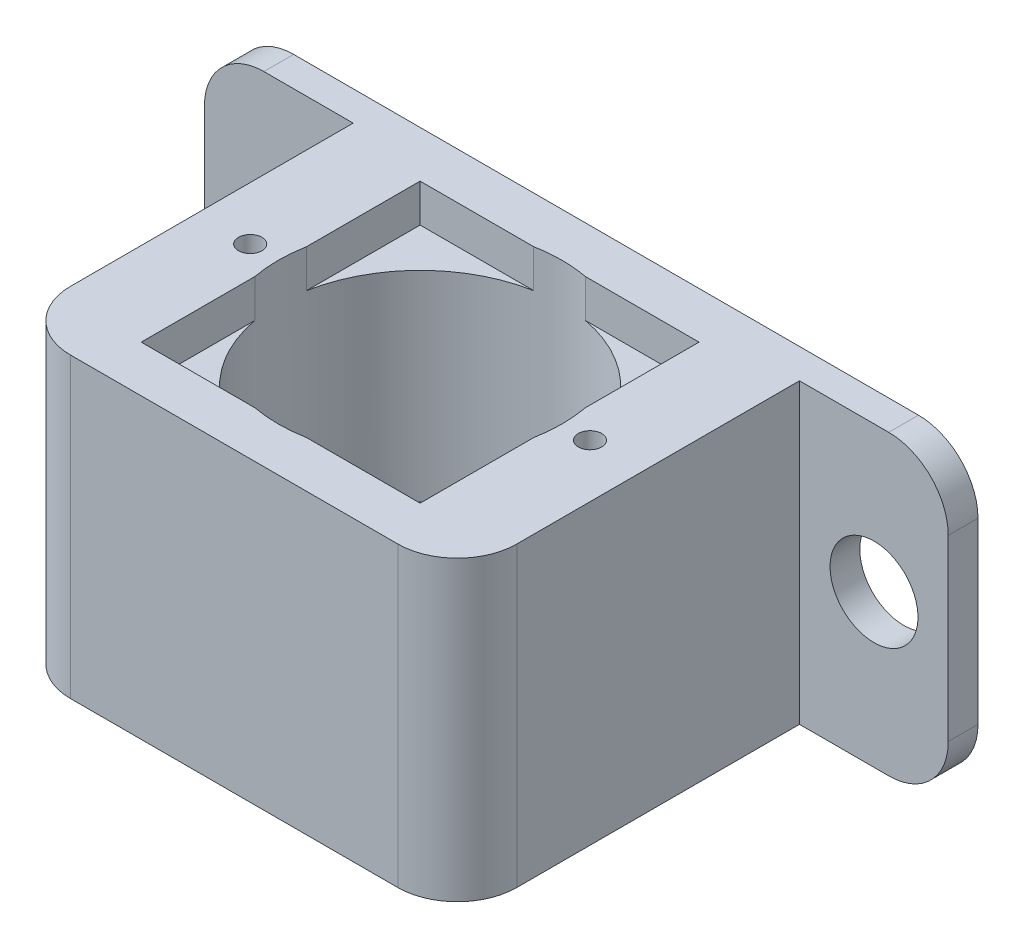
ISO-10303-21;
HEADER;
FILE_DESCRIPTION(('STEP AP214'),'2;1');
FILE_NAME('part.step','',(''),(''),'','','');
FILE_SCHEMA(('AUTOMOTIVE_DESIGN { 1 0 10303 214 1 1 1 1 }'));
ENDSEC;
DATA;
#1=APPLICATION_CONTEXT('core data for automotive mechanical design processes');
#2=APPLICATION_PROTOCOL_DEFINITION('international standard','automotive_design',2000,#1);
#3=PRODUCT_CONTEXT('',#1,'mechanical');
#4=PRODUCT('Part','Part','',(#3));
#5=PRODUCT_RELATED_PRODUCT_CATEGORY('part','',(#4));
#6=PRODUCT_DEFINITION_FORMATION('','',#4);
#7=PRODUCT_DEFINITION_CONTEXT('part definition',#1,'design');
#8=PRODUCT_DEFINITION('design','',#6,#7);
#9=PRODUCT_DEFINITION_SHAPE('','',#8);
#10=(LENGTH_UNIT() NAMED_UNIT(*) SI_UNIT(.MILLI.,.METRE.));
#11=(NAMED_UNIT(*) PLANE_ANGLE_UNIT() SI_UNIT($,.RADIAN.));
#12=(NAMED_UNIT(*) SI_UNIT($,.STERADIAN.) SOLID_ANGLE_UNIT());
#13=UNCERTAINTY_MEASURE_WITH_UNIT(LENGTH_MEASURE(1.E-05),#10,'distance_accuracy_value','');
#14=(GEOMETRIC_REPRESENTATION_CONTEXT(3) GLOBAL_UNCERTAINTY_ASSIGNED_CONTEXT((#13)) GLOBAL_UNIT_ASSIGNED_CONTEXT((#10,
#11,#12)) REPRESENTATION_CONTEXT('',''));
#15=CARTESIAN_POINT('',(0.,0.,0.));
#16=DIRECTION('',(0.,0.,1.));
#17=DIRECTION('',(1.,0.,0.));
#18=AXIS2_PLACEMENT_3D('',#15,#16,#17);
#19=CARTESIAN_POINT('',(0.,-2.54,0.));
#20=DIRECTION('',(0.,-1.,0.));
#21=DIRECTION('',(0.,0.,-1.));
#22=AXIS2_PLACEMENT_3D('',#19,#20,#21);
#23=PLANE('',#22);
#24=CARTESIAN_POINT('',(14.5034,-2.54,0.));
#25=DIRECTION('',(0.,-1.,0.));
#26=DIRECTION('',(0.,0.,-1.));
#27=AXIS2_PLACEMENT_3D('',#24,#25,#26);
#28=CIRCLE('',#27,1.);
#29=CARTESIAN_POINT('',(14.5034,-2.54,-1.));
#30=VERTEX_POINT('',#29);
#31=EDGE_CURVE('E20',#30,#30,#28,.F.);
#32=ORIENTED_EDGE('',*,*,#31,.T.);
#33=EDGE_LOOP('',(#32));
#34=FACE_BOUND('',#33,.T.);
#35=ADVANCED_FACE('F17',(#34),#23,.F.);
#36=CARTESIAN_POINT('',(0.,-2.54,0.));
#37=DIRECTION('',(0.,-1.,0.));
#38=DIRECTION('',(0.,0.,-1.));
#39=AXIS2_PLACEMENT_3D('',#36,#37,#38);
#40=PLANE('',#39);
#41=CARTESIAN_POINT('',(-14.5034,-2.54,0.));
#42=DIRECTION('',(0.,-1.,0.));
#43=DIRECTION('',(0.,0.,-1.));
#44=AXIS2_PLACEMENT_3D('',#41,#42,#43);
#45=CIRCLE('',#44,1.);
#46=CARTESIAN_POINT('',(-14.5034,-2.54,-1.));
#47=VERTEX_POINT('',#46);
#48=EDGE_CURVE('E421',#47,#47,#45,.F.);
#49=ORIENTED_EDGE('',*,*,#48,.T.);
#50=EDGE_LOOP('',(#49));
#51=FACE_BOUND('',#50,.T.);
#52=ADVANCED_FACE('F652',(#51),#40,.F.);
#53=CARTESIAN_POINT('',(-25.4129609454085,-12.4235546093226,-38.735));
#54=DIRECTION('',(0.,0.,-1.));
#55=DIRECTION('',(-1.,0.,0.));
#56=AXIS2_PLACEMENT_3D('',#53,#54,#55);
#57=CYLINDRICAL_SURFACE('',#56,3.754);
#58=CARTESIAN_POINT('',(-25.4129609454085,-12.4235546093226,-13.335));
#59=DIRECTION('',(0.,0.,-1.));
#60=DIRECTION('',(-1.,0.,0.));
#61=AXIS2_PLACEMENT_3D('',#58,#59,#60);
#62=CIRCLE('',#61,3.754);
#63=CARTESIAN_POINT('',(-29.1669609454085,-12.4235546093226,-13.335));
#64=VERTEX_POINT('',#63);
#65=EDGE_CURVE('E377',#64,#64,#62,.F.);
#66=ORIENTED_EDGE('',*,*,#65,.T.);
#67=EDGE_LOOP('',(#66));
#68=FACE_BOUND('',#67,.T.);
#69=CARTESIAN_POINT('',(-25.4129609454085,-12.4235546093226,-15.875));
#70=DIRECTION('',(0.,0.,-1.));
#71=DIRECTION('',(-1.,0.,0.));
#72=AXIS2_PLACEMENT_3D('',#69,#70,#71);
#73=CIRCLE('',#72,3.754);
#74=CARTESIAN_POINT('',(-29.1669609454085,-12.4235546093226,-15.875));
#75=VERTEX_POINT('',#74);
#76=EDGE_CURVE('E460',#75,#75,#73,.F.);
#77=ORIENTED_EDGE('',*,*,#76,.F.);
#78=EDGE_LOOP('',(#77));
#79=FACE_BOUND('',#78,.T.);
#80=ADVANCED_FACE('F646',(#68,#79),#57,.F.);
#81=CARTESIAN_POINT('',(25.4129609454085,-12.4235546093226,-38.735));
#82=DIRECTION('',(0.,0.,-1.));
#83=DIRECTION('',(-1.,0.,0.));
#84=AXIS2_PLACEMENT_3D('',#81,#82,#83);
#85=CYLINDRICAL_SURFACE('',#84,3.754);
#86=CARTESIAN_POINT('',(25.4129609454085,-12.4235546093226,-13.335));
#87=DIRECTION('',(0.,0.,-1.));
#88=DIRECTION('',(-1.,0.,0.));
#89=AXIS2_PLACEMENT_3D('',#86,#87,#88);
#90=CIRCLE('',#89,3.754);
#91=CARTESIAN_POINT('',(21.6589609454085,-12.4235546093226,-13.335));
#92=VERTEX_POINT('',#91);
#93=EDGE_CURVE('E420',#92,#92,#90,.T.);
#94=ORIENTED_EDGE('',*,*,#93,.F.);
#95=EDGE_LOOP('',(#94));
#96=FACE_BOUND('',#95,.T.);
#97=CARTESIAN_POINT('',(25.4129609454085,-12.4235546093226,-15.875));
#98=DIRECTION('',(0.,0.,-1.));
#99=DIRECTION('',(-1.,0.,0.));
#100=AXIS2_PLACEMENT_3D('',#97,#98,#99);
#101=CIRCLE('',#100,3.754);
#102=CARTESIAN_POINT('',(21.6589609454085,-12.4235546093226,-15.875));
#103=VERTEX_POINT('',#102);
#104=EDGE_CURVE('E457',#103,#103,#101,.F.);
#105=ORIENTED_EDGE('',*,*,#104,.F.);
#106=EDGE_LOOP('',(#105));
#107=FACE_BOUND('',#106,.T.);
#108=ADVANCED_FACE('F639',(#96,#107),#85,.F.);
#109=CARTESIAN_POINT('',(-31.75,-12.7,0.));
#110=DIRECTION('',(-1.,0.,0.));
#111=DIRECTION('',(0.,0.,1.));
#112=AXIS2_PLACEMENT_3D('',#109,#110,#111);
#113=PLANE('',#112);
#114=DIRECTION('',(0.,1.,0.));
#115=VECTOR('',#114,1.);
#116=CARTESIAN_POINT('',(-31.75,-12.7,-13.335));
#117=LINE('',#116,#115);
#118=CARTESIAN_POINT('',(-31.75,-20.32,-13.335));
#119=VERTEX_POINT('',#118);
#120=CARTESIAN_POINT('',(-31.75,-5.08,-13.335));
#121=VERTEX_POINT('',#120);
#122=EDGE_CURVE('E370',#119,#121,#117,.T.);
#123=ORIENTED_EDGE('',*,*,#122,.T.);
#124=DIRECTION('',(0.,0.,1.));
#125=VECTOR('',#124,1.);
#126=CARTESIAN_POINT('',(-31.75,-5.08,0.));
#127=LINE('',#126,#125);
#128=CARTESIAN_POINT('',(-31.75,-5.08,-15.875));
#129=VERTEX_POINT('',#128);
#130=EDGE_CURVE('E373',#129,#121,#127,.T.);
#131=ORIENTED_EDGE('',*,*,#130,.F.);
#132=DIRECTION('',(0.,1.,0.));
#133=VECTOR('',#132,1.);
#134=CARTESIAN_POINT('',(-31.75,-25.4,-15.875));
#135=LINE('',#134,#133);
#136=CARTESIAN_POINT('',(-31.75,-20.32,-15.875));
#137=VERTEX_POINT('',#136);
#138=EDGE_CURVE('E353',#137,#129,#135,.T.);
#139=ORIENTED_EDGE('',*,*,#138,.F.);
#140=DIRECTION('',(0.,0.,-1.));
#141=VECTOR('',#140,1.);
#142=CARTESIAN_POINT('',(-31.75,-20.32,0.));
#143=LINE('',#142,#141);
#144=EDGE_CURVE('E417',#119,#137,#143,.T.);
#145=ORIENTED_EDGE('',*,*,#144,.F.);
#146=EDGE_LOOP('',(#123,#131,#139,#145));
#147=FACE_BOUND('',#146,.T.);
#148=ADVANCED_FACE('F637',(#147),#113,.T.);
#149=CARTESIAN_POINT('',(31.75,-12.7,0.));
#150=DIRECTION('',(1.,0.,0.));
#151=DIRECTION('',(0.,0.,-1.));
#152=AXIS2_PLACEMENT_3D('',#149,#150,#151);
#153=PLANE('',#152);
#154=DIRECTION('',(0.,1.,0.));
#155=VECTOR('',#154,1.);
#156=CARTESIAN_POINT('',(31.75,-25.4,-15.875));
#157=LINE('',#156,#155);
#158=CARTESIAN_POINT('',(31.75,-5.08,-15.875));
#159=VERTEX_POINT('',#158);
#160=CARTESIAN_POINT('',(31.75,-20.32,-15.875));
#161=VERTEX_POINT('',#160);
#162=EDGE_CURVE('E349',#159,#161,#157,.F.);
#163=ORIENTED_EDGE('',*,*,#162,.F.);
#164=DIRECTION('',(0.,0.,1.));
#165=VECTOR('',#164,1.);
#166=CARTESIAN_POINT('',(31.75,-5.08,0.));
#167=LINE('',#166,#165);
#168=CARTESIAN_POINT('',(31.75,-5.08,-13.335));
#169=VERTEX_POINT('',#168);
#170=EDGE_CURVE('E418',#169,#159,#167,.F.);
#171=ORIENTED_EDGE('',*,*,#170,.F.);
#172=DIRECTION('',(0.,1.,0.));
#173=VECTOR('',#172,1.);
#174=CARTESIAN_POINT('',(31.75,-12.7,-13.335));
#175=LINE('',#174,#173);
#176=CARTESIAN_POINT('',(31.75,-20.32,-13.335));
#177=VERTEX_POINT('',#176);
#178=EDGE_CURVE('E398',#177,#169,#175,.T.);
#179=ORIENTED_EDGE('',*,*,#178,.F.);
#180=DIRECTION('',(0.,0.,-1.));
#181=VECTOR('',#180,1.);
#182=CARTESIAN_POINT('',(31.75,-20.32,0.));
#183=LINE('',#182,#181);
#184=EDGE_CURVE('E414',#161,#177,#183,.F.);
#185=ORIENTED_EDGE('',*,*,#184,.F.);
#186=EDGE_LOOP('',(#163,#171,#179,#185));
#187=FACE_BOUND('',#186,.T.);
#188=ADVANCED_FACE('F613',(#187),#153,.T.);
#189=CARTESIAN_POINT('',(-26.67,-20.32,0.));
#190=DIRECTION('',(0.,0.,-1.));
#191=DIRECTION('',(-1.,0.,0.));
#192=AXIS2_PLACEMENT_3D('',#189,#190,#191);
#193=CYLINDRICAL_SURFACE('',#192,5.08);
#194=CARTESIAN_POINT('',(-26.67,-20.32,-13.335));
#195=DIRECTION('',(0.,0.,-1.));
#196=DIRECTION('',(-1.,0.,0.));
#197=AXIS2_PLACEMENT_3D('',#194,#195,#196);
#198=CIRCLE('',#197,5.08);
#199=CARTESIAN_POINT('',(-26.67,-25.4,-13.335));
#200=VERTEX_POINT('',#199);
#201=EDGE_CURVE('E374',#200,#119,#198,.T.);
#202=ORIENTED_EDGE('',*,*,#201,.T.);
#203=ORIENTED_EDGE('',*,*,#144,.T.);
#204=CARTESIAN_POINT('',(-26.67,-20.32,-15.875));
#205=DIRECTION('',(0.,0.,-1.));
#206=DIRECTION('',(-1.,0.,0.));
#207=AXIS2_PLACEMENT_3D('',#204,#205,#206);
#208=CIRCLE('',#207,5.08);
#209=CARTESIAN_POINT('',(-26.67,-25.4,-15.875));
#210=VERTEX_POINT('',#209);
#211=EDGE_CURVE('E356',#210,#137,#208,.T.);
#212=ORIENTED_EDGE('',*,*,#211,.F.);
#213=DIRECTION('',(0.,0.,-1.));
#214=VECTOR('',#213,1.);
#215=CARTESIAN_POINT('',(-26.67,-25.4,0.));
#216=LINE('',#215,#214);
#217=EDGE_CURVE('E404',#200,#210,#216,.T.);
#218=ORIENTED_EDGE('',*,*,#217,.F.);
#219=EDGE_LOOP('',(#202,#203,#212,#218));
#220=FACE_BOUND('',#219,.T.);
#221=ADVANCED_FACE('F493',(#220),#193,.T.);
#222=CARTESIAN_POINT('',(26.67,-20.32,0.));
#223=DIRECTION('',(0.,0.,-1.));
#224=DIRECTION('',(-1.,0.,0.));
#225=AXIS2_PLACEMENT_3D('',#222,#223,#224);
#226=CYLINDRICAL_SURFACE('',#225,5.08);
#227=CARTESIAN_POINT('',(26.67,-20.32,-13.335));
#228=DIRECTION('',(0.,0.,-1.));
#229=DIRECTION('',(-1.,0.,0.));
#230=AXIS2_PLACEMENT_3D('',#227,#228,#229);
#231=CIRCLE('',#230,5.08);
#232=CARTESIAN_POINT('',(26.67,-25.4,-13.335));
#233=VERTEX_POINT('',#232);
#234=EDGE_CURVE('E400',#233,#177,#231,.F.);
#235=ORIENTED_EDGE('',*,*,#234,.F.);
#236=DIRECTION('',(0.,0.,-1.));
#237=VECTOR('',#236,1.);
#238=CARTESIAN_POINT('',(26.67,-25.4,0.));
#239=LINE('',#238,#237);
#240=CARTESIAN_POINT('',(26.67,-25.4,-15.875));
#241=VERTEX_POINT('',#240);
#242=EDGE_CURVE('E162',#241,#233,#239,.F.);
#243=ORIENTED_EDGE('',*,*,#242,.F.);
#244=CARTESIAN_POINT('',(26.67,-20.32,-15.875));
#245=DIRECTION('',(0.,0.,-1.));
#246=DIRECTION('',(-1.,0.,0.));
#247=AXIS2_PLACEMENT_3D('',#244,#245,#246);
#248=CIRCLE('',#247,5.08);
#249=EDGE_CURVE('E351',#161,#241,#248,.T.);
#250=ORIENTED_EDGE('',*,*,#249,.F.);
#251=ORIENTED_EDGE('',*,*,#184,.T.);
#252=EDGE_LOOP('',(#235,#243,#250,#251));
#253=FACE_BOUND('',#252,.T.);
#254=ADVANCED_FACE('F482',(#253),#226,.T.);
#255=CARTESIAN_POINT('',(14.5034,-2.54,0.));
#256=DIRECTION('',(0.,-1.,0.));
#257=DIRECTION('',(0.,0.,-1.));
#258=AXIS2_PLACEMENT_3D('',#255,#256,#257);
#259=CYLINDRICAL_SURFACE('',#258,1.);
#260=CARTESIAN_POINT('',(14.5034,0.,0.));
#261=DIRECTION('',(0.,-1.,0.));
#262=DIRECTION('',(0.,0.,-1.));
#263=AXIS2_PLACEMENT_3D('',#260,#261,#262);
#264=CIRCLE('',#263,1.);
#265=CARTESIAN_POINT('',(14.5034,0.,-1.));
#266=VERTEX_POINT('',#265);
#267=EDGE_CURVE('E277',#266,#266,#264,.F.);
#268=ORIENTED_EDGE('',*,*,#267,.T.);
#269=EDGE_LOOP('',(#268));
#270=FACE_BOUND('',#269,.T.);
#271=ORIENTED_EDGE('',*,*,#31,.F.);
#272=EDGE_LOOP('',(#271));
#273=FACE_BOUND('',#272,.T.);
#274=ADVANCED_FACE('F479',(#270,#273),#259,.F.);
#275=CARTESIAN_POINT('',(-14.5034,-2.54,0.));
#276=DIRECTION('',(0.,-1.,0.));
#277=DIRECTION('',(0.,0.,-1.));
#278=AXIS2_PLACEMENT_3D('',#275,#276,#277);
#279=CYLINDRICAL_SURFACE('',#278,1.);
#280=CARTESIAN_POINT('',(-14.5034,0.,0.));
#281=DIRECTION('',(0.,-1.,0.));
#282=DIRECTION('',(0.,0.,-1.));
#283=AXIS2_PLACEMENT_3D('',#280,#281,#282);
#284=CIRCLE('',#283,1.);
#285=CARTESIAN_POINT('',(-14.5034,0.,-1.));
#286=VERTEX_POINT('',#285);
#287=EDGE_CURVE('E365',#286,#286,#284,.F.);
#288=ORIENTED_EDGE('',*,*,#287,.T.);
#289=EDGE_LOOP('',(#288));
#290=FACE_BOUND('',#289,.T.);
#291=ORIENTED_EDGE('',*,*,#48,.F.);
#292=EDGE_LOOP('',(#291));
#293=FACE_BOUND('',#292,.T.);
#294=ADVANCED_FACE('F481',(#290,#293),#279,.F.);
#295=CARTESIAN_POINT('',(26.67,-5.08,0.));
#296=DIRECTION('',(0.,0.,1.));
#297=DIRECTION('',(1.,0.,0.));
#298=AXIS2_PLACEMENT_3D('',#295,#296,#297);
#299=CYLINDRICAL_SURFACE('',#298,5.08);
#300=CARTESIAN_POINT('',(26.67,-5.08,-13.335));
#301=DIRECTION('',(0.,0.,1.));
#302=DIRECTION('',(1.,0.,0.));
#303=AXIS2_PLACEMENT_3D('',#300,#301,#302);
#304=CIRCLE('',#303,5.08);
#305=CARTESIAN_POINT('',(26.67,0.,-13.335));
#306=VERTEX_POINT('',#305);
#307=EDGE_CURVE('E391',#169,#306,#304,.T.);
#308=ORIENTED_EDGE('',*,*,#307,.F.);
#309=ORIENTED_EDGE('',*,*,#170,.T.);
#310=CARTESIAN_POINT('',(26.67,-5.08,-15.875));
#311=DIRECTION('',(0.,0.,1.));
#312=DIRECTION('',(1.,0.,0.));
#313=AXIS2_PLACEMENT_3D('',#310,#311,#312);
#314=CIRCLE('',#313,5.08);
#315=CARTESIAN_POINT('',(26.67,0.,-15.875));
#316=VERTEX_POINT('',#315);
#317=EDGE_CURVE('E352',#316,#159,#314,.F.);
#318=ORIENTED_EDGE('',*,*,#317,.F.);
#319=DIRECTION('',(0.,0.,-1.));
#320=VECTOR('',#319,1.);
#321=CARTESIAN_POINT('',(26.67,0.,0.));
#322=LINE('',#321,#320);
#323=EDGE_CURVE('E362',#316,#306,#322,.F.);
#324=ORIENTED_EDGE('',*,*,#323,.T.);
#325=EDGE_LOOP('',(#308,#309,#318,#324));
#326=FACE_BOUND('',#325,.T.);
#327=ADVANCED_FACE('F490',(#326),#299,.T.);
#328=CARTESIAN_POINT('',(31.75,-12.7,-13.335));
#329=DIRECTION('',(0.,0.,1.));
#330=DIRECTION('',(1.,0.,0.));
#331=AXIS2_PLACEMENT_3D('',#328,#329,#330);
#332=PLANE('',#331);
#333=DIRECTION('',(1.,0.,0.));
#334=VECTOR('',#333,1.);
#335=CARTESIAN_POINT('',(0.,0.,-13.335));
#336=LINE('',#335,#334);
#337=CARTESIAN_POINT('',(19.05,0.,-13.335));
#338=VERTEX_POINT('',#337);
#339=EDGE_CURVE('E268',#306,#338,#336,.F.);
#340=ORIENTED_EDGE('',*,*,#339,.T.);
#341=DIRECTION('',(0.,1.,0.));
#342=VECTOR('',#341,1.);
#343=CARTESIAN_POINT('',(19.05,-25.4,-13.335));
#344=LINE('',#343,#342);
#345=CARTESIAN_POINT('',(19.05,-25.4,-13.335));
#346=VERTEX_POINT('',#345);
#347=EDGE_CURVE('E389',#338,#346,#344,.F.);
#348=ORIENTED_EDGE('',*,*,#347,.T.);
#349=DIRECTION('',(1.,0.,0.));
#350=VECTOR('',#349,1.);
#351=CARTESIAN_POINT('',(0.,-25.4,-13.335));
#352=LINE('',#351,#350);
#353=EDGE_CURVE('E165',#233,#346,#352,.F.);
#354=ORIENTED_EDGE('',*,*,#353,.F.);
#355=ORIENTED_EDGE('',*,*,#234,.T.);
#356=ORIENTED_EDGE('',*,*,#178,.T.);
#357=ORIENTED_EDGE('',*,*,#307,.T.);
#358=EDGE_LOOP('',(#340,#348,#354,#355,#356,#357));
#359=FACE_BOUND('',#358,.T.);
#360=ORIENTED_EDGE('',*,*,#93,.T.);
#361=EDGE_LOOP('',(#360));
#362=FACE_BOUND('',#361,.T.);
#363=ADVANCED_FACE('F584',(#359,#362),#332,.T.);
#364=CARTESIAN_POINT('',(19.05,-25.4,0.));
#365=DIRECTION('',(-1.,0.,0.));
#366=DIRECTION('',(0.,0.,1.));
#367=AXIS2_PLACEMENT_3D('',#364,#365,#366);
#368=PLANE('',#367);
#369=DIRECTION('',(0.,-1.,0.));
#370=VECTOR('',#369,1.);
#371=CARTESIAN_POINT('',(19.05,-25.4,10.795));
#372=LINE('',#371,#370);
#373=CARTESIAN_POINT('',(19.05,-25.4,10.795));
#374=VERTEX_POINT('',#373);
#375=CARTESIAN_POINT('',(19.05,0.,10.795));
#376=VERTEX_POINT('',#375);
#377=EDGE_CURVE('E387',#374,#376,#372,.F.);
#378=ORIENTED_EDGE('',*,*,#377,.F.);
#379=DIRECTION('',(0.,0.,-1.));
#380=VECTOR('',#379,1.);
#381=CARTESIAN_POINT('',(19.05,-25.4,0.));
#382=LINE('',#381,#380);
#383=EDGE_CURVE('E334',#346,#374,#382,.F.);
#384=ORIENTED_EDGE('',*,*,#383,.F.);
#385=ORIENTED_EDGE('',*,*,#347,.F.);
#386=DIRECTION('',(0.,0.,-1.));
#387=VECTOR('',#386,1.);
#388=CARTESIAN_POINT('',(19.05,0.,0.));
#389=LINE('',#388,#387);
#390=EDGE_CURVE('E265',#338,#376,#389,.F.);
#391=ORIENTED_EDGE('',*,*,#390,.T.);
#392=EDGE_LOOP('',(#378,#384,#385,#391));
#393=FACE_BOUND('',#392,.T.);
#394=ADVANCED_FACE('F580',(#393),#368,.F.);
#395=CARTESIAN_POINT('',(13.97,-25.4,10.795));
#396=DIRECTION('',(0.,-1.,0.));
#397=DIRECTION('',(0.,0.,-1.));
#398=AXIS2_PLACEMENT_3D('',#395,#396,#397);
#399=CYLINDRICAL_SURFACE('',#398,5.08);
#400=CARTESIAN_POINT('',(13.97,0.,10.795));
#401=DIRECTION('',(0.,-1.,0.));
#402=DIRECTION('',(0.,0.,-1.));
#403=AXIS2_PLACEMENT_3D('',#400,#401,#402);
#404=CIRCLE('',#403,5.08);
#405=CARTESIAN_POINT('',(13.97,0.,15.875));
#406=VERTEX_POINT('',#405);
#407=EDGE_CURVE('E264',#376,#406,#404,.T.);
#408=ORIENTED_EDGE('',*,*,#407,.T.);
#409=DIRECTION('',(0.,1.,0.));
#410=VECTOR('',#409,1.);
#411=CARTESIAN_POINT('',(13.97,-25.4,15.875));
#412=LINE('',#411,#410);
#413=CARTESIAN_POINT('',(13.97,-25.4,15.875));
#414=VERTEX_POINT('',#413);
#415=EDGE_CURVE('E384',#406,#414,#412,.F.);
#416=ORIENTED_EDGE('',*,*,#415,.T.);
#417=CARTESIAN_POINT('',(13.97,-25.4,10.795));
#418=DIRECTION('',(0.,-1.,0.));
#419=DIRECTION('',(0.,0.,-1.));
#420=AXIS2_PLACEMENT_3D('',#417,#418,#419);
#421=CIRCLE('',#420,5.08);
#422=EDGE_CURVE('E333',#374,#414,#421,.T.);
#423=ORIENTED_EDGE('',*,*,#422,.F.);
#424=ORIENTED_EDGE('',*,*,#377,.T.);
#425=EDGE_LOOP('',(#408,#416,#423,#424));
#426=FACE_BOUND('',#425,.T.);
#427=ADVANCED_FACE('F576',(#426),#399,.T.);
#428=CARTESIAN_POINT('',(0.,-25.4,15.875));
#429=DIRECTION('',(0.,0.,-1.));
#430=DIRECTION('',(-1.,0.,0.));
#431=AXIS2_PLACEMENT_3D('',#428,#429,#430);
#432=PLANE('',#431);
#433=ORIENTED_EDGE('',*,*,#415,.F.);
#434=DIRECTION('',(1.,0.,0.));
#435=VECTOR('',#434,1.);
#436=CARTESIAN_POINT('',(0.,0.,15.875));
#437=LINE('',#436,#435);
#438=CARTESIAN_POINT('',(-13.97,0.,15.875));
#439=VERTEX_POINT('',#438);
#440=EDGE_CURVE('E261',#406,#439,#437,.F.);
#441=ORIENTED_EDGE('',*,*,#440,.T.);
#442=DIRECTION('',(0.,1.,0.));
#443=VECTOR('',#442,1.);
#444=CARTESIAN_POINT('',(-13.97,-25.4,15.875));
#445=LINE('',#444,#443);
#446=CARTESIAN_POINT('',(-13.97,-25.4,15.875));
#447=VERTEX_POINT('',#446);
#448=EDGE_CURVE('E382',#447,#439,#445,.T.);
#449=ORIENTED_EDGE('',*,*,#448,.F.);
#450=DIRECTION('',(1.,0.,0.));
#451=VECTOR('',#450,1.);
#452=CARTESIAN_POINT('',(0.,-25.4,15.875));
#453=LINE('',#452,#451);
#454=EDGE_CURVE('E331',#414,#447,#453,.F.);
#455=ORIENTED_EDGE('',*,*,#454,.F.);
#456=EDGE_LOOP('',(#433,#441,#449,#455));
#457=FACE_BOUND('',#456,.T.);
#458=ADVANCED_FACE('F572',(#457),#432,.F.);
#459=CARTESIAN_POINT('',(-13.97,-25.4,10.795));
#460=DIRECTION('',(0.,1.,0.));
#461=DIRECTION('',(0.,0.,1.));
#462=AXIS2_PLACEMENT_3D('',#459,#460,#461);
#463=CYLINDRICAL_SURFACE('',#462,5.08);
#464=CARTESIAN_POINT('',(-13.97,0.,10.795));
#465=DIRECTION('',(0.,1.,0.));
#466=DIRECTION('',(0.,0.,1.));
#467=AXIS2_PLACEMENT_3D('',#464,#465,#466);
#468=CIRCLE('',#467,5.08);
#469=CARTESIAN_POINT('',(-19.05,0.,10.795));
#470=VERTEX_POINT('',#469);
#471=EDGE_CURVE('E258',#439,#470,#468,.F.);
#472=ORIENTED_EDGE('',*,*,#471,.T.);
#473=DIRECTION('',(0.,1.,0.));
#474=VECTOR('',#473,1.);
#475=CARTESIAN_POINT('',(-19.05,-25.4,10.795));
#476=LINE('',#475,#474);
#477=CARTESIAN_POINT('',(-19.05,-25.4,10.795));
#478=VERTEX_POINT('',#477);
#479=EDGE_CURVE('E380',#478,#470,#476,.T.);
#480=ORIENTED_EDGE('',*,*,#479,.F.);
#481=CARTESIAN_POINT('',(-13.97,-25.4,10.795));
#482=DIRECTION('',(0.,1.,0.));
#483=DIRECTION('',(0.,0.,1.));
#484=AXIS2_PLACEMENT_3D('',#481,#482,#483);
#485=CIRCLE('',#484,5.08);
#486=EDGE_CURVE('E328',#447,#478,#485,.F.);
#487=ORIENTED_EDGE('',*,*,#486,.F.);
#488=ORIENTED_EDGE('',*,*,#448,.T.);
#489=EDGE_LOOP('',(#472,#480,#487,#488));
#490=FACE_BOUND('',#489,.T.);
#491=ADVANCED_FACE('F568',(#490),#463,.T.);
#492=CARTESIAN_POINT('',(-19.05,-25.4,0.));
#493=DIRECTION('',(-1.,0.,0.));
#494=DIRECTION('',(0.,0.,1.));
#495=AXIS2_PLACEMENT_3D('',#492,#493,#494);
#496=PLANE('',#495);
#497=DIRECTION('',(0.,0.,-1.));
#498=VECTOR('',#497,1.);
#499=CARTESIAN_POINT('',(-19.05,0.,0.));
#500=LINE('',#499,#498);
#501=CARTESIAN_POINT('',(-19.05,0.,-13.335));
#502=VERTEX_POINT('',#501);
#503=EDGE_CURVE('E254',#470,#502,#500,.T.);
#504=ORIENTED_EDGE('',*,*,#503,.T.);
#505=DIRECTION('',(0.,1.,0.));
#506=VECTOR('',#505,1.);
#507=CARTESIAN_POINT('',(-19.05,-12.7,-13.335));
#508=LINE('',#507,#506);
#509=CARTESIAN_POINT('',(-19.05,-25.4,-13.335));
#510=VERTEX_POINT('',#509);
#511=EDGE_CURVE('E375',#502,#510,#508,.F.);
#512=ORIENTED_EDGE('',*,*,#511,.T.);
#513=DIRECTION('',(0.,0.,-1.));
#514=VECTOR('',#513,1.);
#515=CARTESIAN_POINT('',(-19.05,-25.4,0.));
#516=LINE('',#515,#514);
#517=EDGE_CURVE('E320',#478,#510,#516,.T.);
#518=ORIENTED_EDGE('',*,*,#517,.F.);
#519=ORIENTED_EDGE('',*,*,#479,.T.);
#520=EDGE_LOOP('',(#504,#512,#518,#519));
#521=FACE_BOUND('',#520,.T.);
#522=ADVANCED_FACE('F564',(#521),#496,.T.);
#523=CARTESIAN_POINT('',(-31.75,-12.7,-13.335));
#524=DIRECTION('',(0.,0.,-1.));
#525=DIRECTION('',(-1.,0.,0.));
#526=AXIS2_PLACEMENT_3D('',#523,#524,#525);
#527=PLANE('',#526);
#528=ORIENTED_EDGE('',*,*,#201,.F.);
#529=DIRECTION('',(1.,0.,0.));
#530=VECTOR('',#529,1.);
#531=CARTESIAN_POINT('',(0.,-25.4,-13.335));
#532=LINE('',#531,#530);
#533=EDGE_CURVE('E401',#510,#200,#532,.F.);
#534=ORIENTED_EDGE('',*,*,#533,.F.);
#535=ORIENTED_EDGE('',*,*,#511,.F.);
#536=DIRECTION('',(1.,0.,0.));
#537=VECTOR('',#536,1.);
#538=CARTESIAN_POINT('',(0.,0.,-13.335));
#539=LINE('',#538,#537);
#540=CARTESIAN_POINT('',(-26.67,0.,-13.335));
#541=VERTEX_POINT('',#540);
#542=EDGE_CURVE('E257',#502,#541,#539,.F.);
#543=ORIENTED_EDGE('',*,*,#542,.T.);
#544=CARTESIAN_POINT('',(-26.67,-5.08,-13.335));
#545=DIRECTION('',(0.,0.,1.));
#546=DIRECTION('',(1.,0.,0.));
#547=AXIS2_PLACEMENT_3D('',#544,#545,#546);
#548=CIRCLE('',#547,5.08);
#549=EDGE_CURVE('E423',#121,#541,#548,.F.);
#550=ORIENTED_EDGE('',*,*,#549,.F.);
#551=ORIENTED_EDGE('',*,*,#122,.F.);
#552=EDGE_LOOP('',(#528,#534,#535,#543,#550,#551));
#553=FACE_BOUND('',#552,.T.);
#554=ORIENTED_EDGE('',*,*,#65,.F.);
#555=EDGE_LOOP('',(#554));
#556=FACE_BOUND('',#555,.T.);
#557=ADVANCED_FACE('F560',(#553,#556),#527,.F.);
#558=CARTESIAN_POINT('',(-26.67,-5.08,0.));
#559=DIRECTION('',(0.,0.,1.));
#560=DIRECTION('',(1.,0.,0.));
#561=AXIS2_PLACEMENT_3D('',#558,#559,#560);
#562=CYLINDRICAL_SURFACE('',#561,5.08);
#563=ORIENTED_EDGE('',*,*,#549,.T.);
#564=DIRECTION('',(0.,0.,-1.));
#565=VECTOR('',#564,1.);
#566=CARTESIAN_POINT('',(-26.67,0.,0.));
#567=LINE('',#566,#565);
#568=CARTESIAN_POINT('',(-26.67,0.,-15.875));
#569=VERTEX_POINT('',#568);
#570=EDGE_CURVE('E357',#541,#569,#567,.T.);
#571=ORIENTED_EDGE('',*,*,#570,.T.);
#572=CARTESIAN_POINT('',(-26.67,-5.08,-15.875));
#573=DIRECTION('',(0.,0.,1.));
#574=DIRECTION('',(1.,0.,0.));
#575=AXIS2_PLACEMENT_3D('',#572,#573,#574);
#576=CIRCLE('',#575,5.08);
#577=EDGE_CURVE('E355',#129,#569,#576,.F.);
#578=ORIENTED_EDGE('',*,*,#577,.F.);
#579=ORIENTED_EDGE('',*,*,#130,.T.);
#580=EDGE_LOOP('',(#563,#571,#578,#579));
#581=FACE_BOUND('',#580,.T.);
#582=ADVANCED_FACE('F556',(#581),#562,.T.);
#583=CARTESIAN_POINT('',(0.,-25.4,-15.875));
#584=DIRECTION('',(0.,0.,-1.));
#585=DIRECTION('',(-1.,0.,0.));
#586=AXIS2_PLACEMENT_3D('',#583,#584,#585);
#587=PLANE('',#586);
#588=ORIENTED_EDGE('',*,*,#162,.T.);
#589=ORIENTED_EDGE('',*,*,#249,.T.);
#590=DIRECTION('',(1.,0.,0.));
#591=VECTOR('',#590,1.);
#592=CARTESIAN_POINT('',(0.,-25.4,-15.875));
#593=LINE('',#592,#591);
#594=EDGE_CURVE('E411',#210,#241,#593,.T.);
#595=ORIENTED_EDGE('',*,*,#594,.F.);
#596=ORIENTED_EDGE('',*,*,#211,.T.);
#597=ORIENTED_EDGE('',*,*,#138,.T.);
#598=ORIENTED_EDGE('',*,*,#577,.T.);
#599=DIRECTION('',(1.,0.,0.));
#600=VECTOR('',#599,1.);
#601=CARTESIAN_POINT('',(0.,0.,-15.875));
#602=LINE('',#601,#600);
#603=EDGE_CURVE('E251',#569,#316,#602,.T.);
#604=ORIENTED_EDGE('',*,*,#603,.T.);
#605=ORIENTED_EDGE('',*,*,#317,.T.);
#606=EDGE_LOOP('',(#588,#589,#595,#596,#597,#598,#604,#605));
#607=FACE_BOUND('',#606,.T.);
#608=ORIENTED_EDGE('',*,*,#104,.T.);
#609=EDGE_LOOP('',(#608));
#610=FACE_BOUND('',#609,.T.);
#611=ORIENTED_EDGE('',*,*,#76,.T.);
#612=EDGE_LOOP('',(#611));
#613=FACE_BOUND('',#612,.T.);
#614=ADVANCED_FACE('F553',(#607,#610,#613),#587,.T.);
#615=CARTESIAN_POINT('',(0.,-25.4,0.));
#616=DIRECTION('',(0.,-1.,0.));
#617=DIRECTION('',(0.,0.,-1.));
#618=AXIS2_PLACEMENT_3D('',#615,#616,#617);
#619=PLANE('',#618);
#620=ORIENTED_EDGE('',*,*,#486,.T.);
#621=ORIENTED_EDGE('',*,*,#517,.T.);
#622=ORIENTED_EDGE('',*,*,#533,.T.);
#623=ORIENTED_EDGE('',*,*,#217,.T.);
#624=ORIENTED_EDGE('',*,*,#594,.T.);
#625=ORIENTED_EDGE('',*,*,#242,.T.);
#626=ORIENTED_EDGE('',*,*,#353,.T.);
#627=ORIENTED_EDGE('',*,*,#383,.T.);
#628=ORIENTED_EDGE('',*,*,#422,.T.);
#629=ORIENTED_EDGE('',*,*,#454,.T.);
#630=EDGE_LOOP('',(#620,#621,#622,#623,#624,#625,#626,#627,#628,#629));
#631=FACE_BOUND('',#630,.T.);
#632=CARTESIAN_POINT('',(0.,-25.4,0.));
#633=DIRECTION('',(0.,-1.,0.));
#634=DIRECTION('',(0.,0.,-1.));
#635=AXIS2_PLACEMENT_3D('',#632,#633,#634);
#636=CIRCLE('',#635,12.108);
#637=CARTESIAN_POINT('',(0.,-25.4,-12.108));
#638=VERTEX_POINT('',#637);
#639=EDGE_CURVE('E205',#638,#638,#636,.F.);
#640=ORIENTED_EDGE('',*,*,#639,.T.);
#641=EDGE_LOOP('',(#640));
#642=FACE_BOUND('',#641,.T.);
#643=ADVANCED_FACE('F550',(#631,#642),#619,.T.);
#644=CARTESIAN_POINT('',(11.9048003107309,-3.25,0.));
#645=DIRECTION('',(-1.,0.,0.));
#646=DIRECTION('',(0.,0.,1.));
#647=AXIS2_PLACEMENT_3D('',#644,#645,#646);
#648=PLANE('',#647);
#649=DIRECTION('',(0.,0.,-1.));
#650=VECTOR('',#649,1.);
#651=CARTESIAN_POINT('',(11.9048003107309,-3.25,0.));
#652=LINE('',#651,#650);
#653=CARTESIAN_POINT('',(11.9048003107309,-3.25,-11.9048003107309));
#654=VERTEX_POINT('',#653);
#655=CARTESIAN_POINT('',(11.9048003107309,-3.25,-2.20893493829516));
#656=VERTEX_POINT('',#655);
#657=EDGE_CURVE('E197',#654,#656,#652,.F.);
#658=ORIENTED_EDGE('',*,*,#657,.T.);
#659=DIRECTION('',(0.,-1.,0.));
#660=VECTOR('',#659,1.);
#661=CARTESIAN_POINT('',(11.9048003107309,-25.4,-2.20893493829507));
#662=LINE('',#661,#660);
#663=CARTESIAN_POINT('',(11.9048003107309,0.,-2.20893493829516));
#664=VERTEX_POINT('',#663);
#665=EDGE_CURVE('E219',#656,#664,#662,.F.);
#666=ORIENTED_EDGE('',*,*,#665,.T.);
#667=DIRECTION('',(0.,0.,-1.));
#668=VECTOR('',#667,1.);
#669=CARTESIAN_POINT('',(11.9048003107309,0.,0.));
#670=LINE('',#669,#668);
#671=CARTESIAN_POINT('',(11.9048003107309,0.,-11.9048003107309));
#672=VERTEX_POINT('',#671);
#673=EDGE_CURVE('E198',#664,#672,#670,.T.);
#674=ORIENTED_EDGE('',*,*,#673,.T.);
#675=DIRECTION('',(0.,1.,0.));
#676=VECTOR('',#675,1.);
#677=CARTESIAN_POINT('',(11.9048003107309,-3.25,-11.9048003107309));
#678=LINE('',#677,#676);
#679=EDGE_CURVE('E194',#654,#672,#678,.T.);
#680=ORIENTED_EDGE('',*,*,#679,.F.);
#681=EDGE_LOOP('',(#658,#666,#674,#680));
#682=FACE_BOUND('',#681,.T.);
#683=ADVANCED_FACE('F195',(#682),#648,.T.);
#684=CARTESIAN_POINT('',(11.9048003107309,-3.25,0.));
#685=DIRECTION('',(-1.,0.,0.));
#686=DIRECTION('',(0.,0.,1.));
#687=AXIS2_PLACEMENT_3D('',#684,#685,#686);
#688=PLANE('',#687);
#689=DIRECTION('',(0.,0.,-1.));
#690=VECTOR('',#689,1.);
#691=CARTESIAN_POINT('',(11.9048003107309,0.,0.));
#692=LINE('',#691,#690);
#693=CARTESIAN_POINT('',(11.9048003107309,0.,11.9048003107309));
#694=VERTEX_POINT('',#693);
#695=CARTESIAN_POINT('',(11.9048003107309,0.,2.20893493829516));
#696=VERTEX_POINT('',#695);
#697=EDGE_CURVE('E233',#694,#696,#692,.T.);
#698=ORIENTED_EDGE('',*,*,#697,.T.);
#699=DIRECTION('',(0.,-1.,0.));
#700=VECTOR('',#699,1.);
#701=CARTESIAN_POINT('',(11.9048003107309,-25.4,2.20893493829507));
#702=LINE('',#701,#700);
#703=CARTESIAN_POINT('',(11.9048003107309,-3.25,2.20893493829516));
#704=VERTEX_POINT('',#703);
#705=EDGE_CURVE('E323',#696,#704,#702,.T.);
#706=ORIENTED_EDGE('',*,*,#705,.T.);
#707=DIRECTION('',(0.,0.,-1.));
#708=VECTOR('',#707,1.);
#709=CARTESIAN_POINT('',(11.9048003107309,-3.25,0.));
#710=LINE('',#709,#708);
#711=CARTESIAN_POINT('',(11.9048003107309,-3.25,11.9048003107309));
#712=VERTEX_POINT('',#711);
#713=EDGE_CURVE('E316',#704,#712,#710,.F.);
#714=ORIENTED_EDGE('',*,*,#713,.T.);
#715=DIRECTION('',(0.,1.,0.));
#716=VECTOR('',#715,1.);
#717=CARTESIAN_POINT('',(11.9048003107309,-3.25,11.9048003107309));
#718=LINE('',#717,#716);
#719=EDGE_CURVE('E302',#712,#694,#718,.T.);
#720=ORIENTED_EDGE('',*,*,#719,.T.);
#721=EDGE_LOOP('',(#698,#706,#714,#720));
#722=FACE_BOUND('',#721,.T.);
#723=ADVANCED_FACE('F543',(#722),#688,.T.);
#724=CARTESIAN_POINT('',(0.,-3.25,0.));
#725=DIRECTION('',(0.,-1.,0.));
#726=DIRECTION('',(0.,0.,-1.));
#727=AXIS2_PLACEMENT_3D('',#724,#725,#726);
#728=PLANE('',#727);
#729=DIRECTION('',(1.,0.,0.));
#730=VECTOR('',#729,1.);
#731=CARTESIAN_POINT('',(0.,-3.25,11.9048003107309));
#732=LINE('',#731,#730);
#733=CARTESIAN_POINT('',(2.20893493829517,-3.25,11.9048003107309));
#734=VERTEX_POINT('',#733);
#735=EDGE_CURVE('E313',#734,#712,#732,.T.);
#736=ORIENTED_EDGE('',*,*,#735,.T.);
#737=ORIENTED_EDGE('',*,*,#713,.F.);
#738=CARTESIAN_POINT('',(0.,-3.25,0.));
#739=DIRECTION('',(0.,-1.,0.));
#740=DIRECTION('',(0.,0.,-1.));
#741=AXIS2_PLACEMENT_3D('',#738,#739,#740);
#742=CIRCLE('',#741,12.108);
#743=EDGE_CURVE('E312',#704,#734,#742,.T.);
#744=ORIENTED_EDGE('',*,*,#743,.T.);
#745=EDGE_LOOP('',(#736,#737,#744));
#746=FACE_BOUND('',#745,.T.);
#747=ADVANCED_FACE('F539',(#746),#728,.F.);
#748=CARTESIAN_POINT('',(0.,-3.25,11.9048003107309));
#749=DIRECTION('',(0.,0.,1.));
#750=DIRECTION('',(1.,0.,0.));
#751=AXIS2_PLACEMENT_3D('',#748,#749,#750);
#752=PLANE('',#751);
#753=DIRECTION('',(1.,0.,0.));
#754=VECTOR('',#753,1.);
#755=CARTESIAN_POINT('',(0.,0.,11.9048003107309));
#756=LINE('',#755,#754);
#757=CARTESIAN_POINT('',(2.20893493829517,0.,11.9048003107309));
#758=VERTEX_POINT('',#757);
#759=EDGE_CURVE('E237',#758,#694,#756,.T.);
#760=ORIENTED_EDGE('',*,*,#759,.T.);
#761=ORIENTED_EDGE('',*,*,#719,.F.);
#762=ORIENTED_EDGE('',*,*,#735,.F.);
#763=DIRECTION('',(0.,-1.,0.));
#764=VECTOR('',#763,1.);
#765=CARTESIAN_POINT('',(2.20893493829508,-25.4,11.9048003107309));
#766=LINE('',#765,#764);
#767=EDGE_CURVE('E309',#734,#758,#766,.F.);
#768=ORIENTED_EDGE('',*,*,#767,.T.);
#769=EDGE_LOOP('',(#760,#761,#762,#768));
#770=FACE_BOUND('',#769,.T.);
#771=ADVANCED_FACE('F535',(#770),#752,.F.);
#772=CARTESIAN_POINT('',(0.,-3.25,11.9048003107309));
#773=DIRECTION('',(0.,0.,1.));
#774=DIRECTION('',(1.,0.,0.));
#775=AXIS2_PLACEMENT_3D('',#772,#773,#774);
#776=PLANE('',#775);
#777=DIRECTION('',(1.,0.,0.));
#778=VECTOR('',#777,1.);
#779=CARTESIAN_POINT('',(0.,-3.25,11.9048003107309));
#780=LINE('',#779,#778);
#781=CARTESIAN_POINT('',(-2.20893493829517,-3.25,11.9048003107309));
#782=VERTEX_POINT('',#781);
#783=CARTESIAN_POINT('',(-11.9048003107309,-3.25,11.9048003107309));
#784=VERTEX_POINT('',#783);
#785=EDGE_CURVE('E298',#782,#784,#780,.F.);
#786=ORIENTED_EDGE('',*,*,#785,.T.);
#787=DIRECTION('',(0.,1.,0.));
#788=VECTOR('',#787,1.);
#789=CARTESIAN_POINT('',(-11.9048003107309,-3.25,11.9048003107309));
#790=LINE('',#789,#788);
#791=CARTESIAN_POINT('',(-11.9048003107309,0.,11.9048003107309));
#792=VERTEX_POINT('',#791);
#793=EDGE_CURVE('E284',#784,#792,#790,.T.);
#794=ORIENTED_EDGE('',*,*,#793,.T.);
#795=DIRECTION('',(1.,0.,0.));
#796=VECTOR('',#795,1.);
#797=CARTESIAN_POINT('',(0.,0.,11.9048003107309));
#798=LINE('',#797,#796);
#799=CARTESIAN_POINT('',(-2.20893493829517,0.,11.9048003107309));
#800=VERTEX_POINT('',#799);
#801=EDGE_CURVE('E242',#792,#800,#798,.T.);
#802=ORIENTED_EDGE('',*,*,#801,.T.);
#803=DIRECTION('',(0.,-1.,0.));
#804=VECTOR('',#803,1.);
#805=CARTESIAN_POINT('',(-2.20893493829507,-25.4,11.9048003107309));
#806=LINE('',#805,#804);
#807=EDGE_CURVE('E305',#800,#782,#806,.T.);
#808=ORIENTED_EDGE('',*,*,#807,.T.);
#809=EDGE_LOOP('',(#786,#794,#802,#808));
#810=FACE_BOUND('',#809,.T.);
#811=ADVANCED_FACE('F531',(#810),#776,.F.);
#812=CARTESIAN_POINT('',(0.,-3.25,0.));
#813=DIRECTION('',(0.,-1.,0.));
#814=DIRECTION('',(0.,0.,-1.));
#815=AXIS2_PLACEMENT_3D('',#812,#813,#814);
#816=PLANE('',#815);
#817=DIRECTION('',(0.,0.,1.));
#818=VECTOR('',#817,1.);
#819=CARTESIAN_POINT('',(-11.9048003107309,-3.25,0.));
#820=LINE('',#819,#818);
#821=CARTESIAN_POINT('',(-11.9048003107309,-3.25,2.20893493829515));
#822=VERTEX_POINT('',#821);
#823=EDGE_CURVE('E295',#822,#784,#820,.T.);
#824=ORIENTED_EDGE('',*,*,#823,.T.);
#825=ORIENTED_EDGE('',*,*,#785,.F.);
#826=CARTESIAN_POINT('',(0.,-3.25,0.));
#827=DIRECTION('',(0.,-1.,0.));
#828=DIRECTION('',(0.,0.,-1.));
#829=AXIS2_PLACEMENT_3D('',#826,#827,#828);
#830=CIRCLE('',#829,12.108);
#831=EDGE_CURVE('E294',#782,#822,#830,.T.);
#832=ORIENTED_EDGE('',*,*,#831,.T.);
#833=EDGE_LOOP('',(#824,#825,#832));
#834=FACE_BOUND('',#833,.T.);
#835=ADVANCED_FACE('F527',(#834),#816,.F.);
#836=CARTESIAN_POINT('',(-11.9048003107309,-3.25,0.));
#837=DIRECTION('',(-1.,0.,0.));
#838=DIRECTION('',(0.,0.,1.));
#839=AXIS2_PLACEMENT_3D('',#836,#837,#838);
#840=PLANE('',#839);
#841=DIRECTION('',(0.,0.,-1.));
#842=VECTOR('',#841,1.);
#843=CARTESIAN_POINT('',(-11.9048003107309,0.,0.));
#844=LINE('',#843,#842);
#845=CARTESIAN_POINT('',(-11.9048003107309,0.,2.20893493829515));
#846=VERTEX_POINT('',#845);
#847=EDGE_CURVE('E246',#846,#792,#844,.F.);
#848=ORIENTED_EDGE('',*,*,#847,.T.);
#849=ORIENTED_EDGE('',*,*,#793,.F.);
#850=ORIENTED_EDGE('',*,*,#823,.F.);
#851=DIRECTION('',(0.,-1.,0.));
#852=VECTOR('',#851,1.);
#853=CARTESIAN_POINT('',(-11.9048003107309,-25.4,2.20893493829505));
#854=LINE('',#853,#852);
#855=EDGE_CURVE('E291',#822,#846,#854,.F.);
#856=ORIENTED_EDGE('',*,*,#855,.T.);
#857=EDGE_LOOP('',(#848,#849,#850,#856));
#858=FACE_BOUND('',#857,.T.);
#859=ADVANCED_FACE('F523',(#858),#840,.F.);
#860=CARTESIAN_POINT('',(-11.9048003107309,-3.25,0.));
#861=DIRECTION('',(-1.,0.,0.));
#862=DIRECTION('',(0.,0.,1.));
#863=AXIS2_PLACEMENT_3D('',#860,#861,#862);
#864=PLANE('',#863);
#865=DIRECTION('',(0.,0.,-1.));
#866=VECTOR('',#865,1.);
#867=CARTESIAN_POINT('',(-11.9048003107309,-3.25,0.));
#868=LINE('',#867,#866);
#869=CARTESIAN_POINT('',(-11.9048003107309,-3.25,-2.20893493829515));
#870=VERTEX_POINT('',#869);
#871=CARTESIAN_POINT('',(-11.9048003107309,-3.25,-11.9048003107309));
#872=VERTEX_POINT('',#871);
#873=EDGE_CURVE('E281',#870,#872,#868,.T.);
#874=ORIENTED_EDGE('',*,*,#873,.T.);
#875=DIRECTION('',(0.,1.,0.));
#876=VECTOR('',#875,1.);
#877=CARTESIAN_POINT('',(-11.9048003107309,-3.25,-11.9048003107309));
#878=LINE('',#877,#876);
#879=CARTESIAN_POINT('',(-11.9048003107309,0.,-11.9048003107309));
#880=VERTEX_POINT('',#879);
#881=EDGE_CURVE('E278',#880,#872,#878,.F.);
#882=ORIENTED_EDGE('',*,*,#881,.F.);
#883=DIRECTION('',(0.,0.,-1.));
#884=VECTOR('',#883,1.);
#885=CARTESIAN_POINT('',(-11.9048003107309,0.,0.));
#886=LINE('',#885,#884);
#887=CARTESIAN_POINT('',(-11.9048003107309,0.,-2.20893493829515));
#888=VERTEX_POINT('',#887);
#889=EDGE_CURVE('E202',#880,#888,#886,.F.);
#890=ORIENTED_EDGE('',*,*,#889,.T.);
#891=DIRECTION('',(0.,-1.,0.));
#892=VECTOR('',#891,1.);
#893=CARTESIAN_POINT('',(-11.9048003107309,-25.4,-2.20893493829504));
#894=LINE('',#893,#892);
#895=EDGE_CURVE('E287',#888,#870,#894,.T.);
#896=ORIENTED_EDGE('',*,*,#895,.T.);
#897=EDGE_LOOP('',(#874,#882,#890,#896));
#898=FACE_BOUND('',#897,.T.);
#899=ADVANCED_FACE('F519',(#898),#864,.F.);
#900=CARTESIAN_POINT('',(0.,-3.25,0.));
#901=DIRECTION('',(0.,-1.,0.));
#902=DIRECTION('',(0.,0.,-1.));
#903=AXIS2_PLACEMENT_3D('',#900,#901,#902);
#904=PLANE('',#903);
#905=DIRECTION('',(1.,0.,0.));
#906=VECTOR('',#905,1.);
#907=CARTESIAN_POINT('',(0.,-3.25,-11.9048003107309));
#908=LINE('',#907,#906);
#909=CARTESIAN_POINT('',(-2.20893493829516,-3.25,-11.9048003107309));
#910=VERTEX_POINT('',#909);
#911=EDGE_CURVE('E275',#872,#910,#908,.T.);
#912=ORIENTED_EDGE('',*,*,#911,.F.);
#913=ORIENTED_EDGE('',*,*,#873,.F.);
#914=CARTESIAN_POINT('',(0.,-3.25,0.));
#915=DIRECTION('',(0.,-1.,0.));
#916=DIRECTION('',(0.,0.,-1.));
#917=AXIS2_PLACEMENT_3D('',#914,#915,#916);
#918=CIRCLE('',#917,12.108);
#919=EDGE_CURVE('E274',#870,#910,#918,.T.);
#920=ORIENTED_EDGE('',*,*,#919,.T.);
#921=EDGE_LOOP('',(#912,#913,#920));
#922=FACE_BOUND('',#921,.T.);
#923=ADVANCED_FACE('F515',(#922),#904,.F.);
#924=CARTESIAN_POINT('',(0.,-3.25,-11.9048003107309));
#925=DIRECTION('',(0.,0.,1.));
#926=DIRECTION('',(1.,0.,0.));
#927=AXIS2_PLACEMENT_3D('',#924,#925,#926);
#928=PLANE('',#927);
#929=ORIENTED_EDGE('',*,*,#911,.T.);
#930=DIRECTION('',(0.,-1.,0.));
#931=VECTOR('',#930,1.);
#932=CARTESIAN_POINT('',(-2.20893493829506,-25.4,-11.9048003107309));
#933=LINE('',#932,#931);
#934=CARTESIAN_POINT('',(-2.20893493829516,0.,-11.9048003107309));
#935=VERTEX_POINT('',#934);
#936=EDGE_CURVE('E271',#910,#935,#933,.F.);
#937=ORIENTED_EDGE('',*,*,#936,.T.);
#938=DIRECTION('',(1.,0.,0.));
#939=VECTOR('',#938,1.);
#940=CARTESIAN_POINT('',(0.,0.,-11.9048003107309));
#941=LINE('',#940,#939);
#942=EDGE_CURVE('E225',#935,#880,#941,.F.);
#943=ORIENTED_EDGE('',*,*,#942,.T.);
#944=ORIENTED_EDGE('',*,*,#881,.T.);
#945=EDGE_LOOP('',(#929,#937,#943,#944));
#946=FACE_BOUND('',#945,.T.);
#947=ADVANCED_FACE('F511',(#946),#928,.T.);
#948=CARTESIAN_POINT('',(0.,0.,0.));
#949=DIRECTION('',(0.,-1.,0.));
#950=DIRECTION('',(0.,0.,-1.));
#951=AXIS2_PLACEMENT_3D('',#948,#949,#950);
#952=PLANE('',#951);
#953=ORIENTED_EDGE('',*,*,#942,.F.);
#954=CARTESIAN_POINT('',(0.,0.,0.));
#955=DIRECTION('',(0.,-1.,0.));
#956=DIRECTION('',(0.,0.,-1.));
#957=AXIS2_PLACEMENT_3D('',#954,#955,#956);
#958=CIRCLE('',#957,12.108);
#959=CARTESIAN_POINT('',(2.20893493829516,0.,-11.9048003107309));
#960=VERTEX_POINT('',#959);
#961=EDGE_CURVE('E218',#935,#960,#958,.T.);
#962=ORIENTED_EDGE('',*,*,#961,.T.);
#963=DIRECTION('',(1.,0.,0.));
#964=VECTOR('',#963,1.);
#965=CARTESIAN_POINT('',(0.,0.,-11.9048003107309));
#966=LINE('',#965,#964);
#967=EDGE_CURVE('E201',#672,#960,#966,.F.);
#968=ORIENTED_EDGE('',*,*,#967,.F.);
#969=ORIENTED_EDGE('',*,*,#673,.F.);
#970=CARTESIAN_POINT('',(0.,0.,0.));
#971=DIRECTION('',(0.,-1.,0.));
#972=DIRECTION('',(0.,0.,-1.));
#973=AXIS2_PLACEMENT_3D('',#970,#971,#972);
#974=CIRCLE('',#973,12.108);
#975=EDGE_CURVE('E220',#664,#696,#974,.T.);
#976=ORIENTED_EDGE('',*,*,#975,.T.);
#977=ORIENTED_EDGE('',*,*,#697,.F.);
#978=ORIENTED_EDGE('',*,*,#759,.F.);
#979=CARTESIAN_POINT('',(0.,0.,0.));
#980=DIRECTION('',(0.,-1.,0.));
#981=DIRECTION('',(0.,0.,-1.));
#982=AXIS2_PLACEMENT_3D('',#979,#980,#981);
#983=CIRCLE('',#982,12.108);
#984=EDGE_CURVE('E308',#758,#800,#983,.T.);
#985=ORIENTED_EDGE('',*,*,#984,.T.);
#986=ORIENTED_EDGE('',*,*,#801,.F.);
#987=ORIENTED_EDGE('',*,*,#847,.F.);
#988=CARTESIAN_POINT('',(0.,0.,0.));
#989=DIRECTION('',(0.,-1.,0.));
#990=DIRECTION('',(0.,0.,-1.));
#991=AXIS2_PLACEMENT_3D('',#988,#989,#990);
#992=CIRCLE('',#991,12.108);
#993=EDGE_CURVE('E290',#846,#888,#992,.T.);
#994=ORIENTED_EDGE('',*,*,#993,.T.);
#995=ORIENTED_EDGE('',*,*,#889,.F.);
#996=EDGE_LOOP('',(#953,#962,#968,#969,#976,#977,#978,#985,#986,#987,#994,#995));
#997=FACE_BOUND('',#996,.T.);
#998=ORIENTED_EDGE('',*,*,#570,.F.);
#999=ORIENTED_EDGE('',*,*,#542,.F.);
#1000=ORIENTED_EDGE('',*,*,#503,.F.);
#1001=ORIENTED_EDGE('',*,*,#471,.F.);
#1002=ORIENTED_EDGE('',*,*,#440,.F.);
#1003=ORIENTED_EDGE('',*,*,#407,.F.);
#1004=ORIENTED_EDGE('',*,*,#390,.F.);
#1005=ORIENTED_EDGE('',*,*,#339,.F.);
#1006=ORIENTED_EDGE('',*,*,#323,.F.);
#1007=ORIENTED_EDGE('',*,*,#603,.F.);
#1008=EDGE_LOOP('',(#998,#999,#1000,#1001,#1002,#1003,#1004,#1005,#1006,#1007));
#1009=FACE_BOUND('',#1008,.T.);
#1010=ORIENTED_EDGE('',*,*,#287,.F.);
#1011=EDGE_LOOP('',(#1010));
#1012=FACE_BOUND('',#1011,.T.);
#1013=ORIENTED_EDGE('',*,*,#267,.F.);
#1014=EDGE_LOOP('',(#1013));
#1015=FACE_BOUND('',#1014,.T.);
#1016=ADVANCED_FACE('F508',(#997,#1009,#1012,#1015),#952,.F.);
#1017=CARTESIAN_POINT('',(0.,-3.25,-11.9048003107309));
#1018=DIRECTION('',(0.,0.,1.));
#1019=DIRECTION('',(1.,0.,0.));
#1020=AXIS2_PLACEMENT_3D('',#1017,#1018,#1019);
#1021=PLANE('',#1020);
#1022=ORIENTED_EDGE('',*,*,#967,.T.);
#1023=DIRECTION('',(0.,-1.,0.));
#1024=VECTOR('',#1023,1.);
#1025=CARTESIAN_POINT('',(2.20893493829506,-25.4,-11.9048003107309));
#1026=LINE('',#1025,#1024);
#1027=CARTESIAN_POINT('',(2.20893493829516,-3.25,-11.9048003107309));
#1028=VERTEX_POINT('',#1027);
#1029=EDGE_CURVE('E26',#960,#1028,#1026,.T.);
#1030=ORIENTED_EDGE('',*,*,#1029,.T.);
#1031=DIRECTION('',(1.,0.,0.));
#1032=VECTOR('',#1031,1.);
#1033=CARTESIAN_POINT('',(0.,-3.25,-11.9048003107309));
#1034=LINE('',#1033,#1032);
#1035=EDGE_CURVE('E34',#1028,#654,#1034,.T.);
#1036=ORIENTED_EDGE('',*,*,#1035,.T.);
#1037=ORIENTED_EDGE('',*,*,#679,.T.);
#1038=EDGE_LOOP('',(#1022,#1030,#1036,#1037));
#1039=FACE_BOUND('',#1038,.T.);
#1040=ADVANCED_FACE('F208',(#1039),#1021,.T.);
#1041=CARTESIAN_POINT('',(0.,-3.25,0.));
#1042=DIRECTION('',(0.,-1.,0.));
#1043=DIRECTION('',(0.,0.,-1.));
#1044=AXIS2_PLACEMENT_3D('',#1041,#1042,#1043);
#1045=PLANE('',#1044);
#1046=ORIENTED_EDGE('',*,*,#657,.F.);
#1047=ORIENTED_EDGE('',*,*,#1035,.F.);
#1048=CARTESIAN_POINT('',(0.,-3.25,0.));
#1049=DIRECTION('',(0.,-1.,0.));
#1050=DIRECTION('',(0.,0.,-1.));
#1051=AXIS2_PLACEMENT_3D('',#1048,#1049,#1050);
#1052=CIRCLE('',#1051,12.108);
#1053=EDGE_CURVE('E11',#1028,#656,#1052,.T.);
#1054=ORIENTED_EDGE('',*,*,#1053,.T.);
#1055=EDGE_LOOP('',(#1046,#1047,#1054));
#1056=FACE_BOUND('',#1055,.T.);
#1057=ADVANCED_FACE('F204',(#1056),#1045,.F.);
#1058=CARTESIAN_POINT('',(0.,-25.4,0.));
#1059=DIRECTION('',(0.,-1.,0.));
#1060=DIRECTION('',(0.,0.,-1.));
#1061=AXIS2_PLACEMENT_3D('',#1058,#1059,#1060);
#1062=CYLINDRICAL_SURFACE('',#1061,12.108);
#1063=ORIENTED_EDGE('',*,*,#1029,.F.);
#1064=ORIENTED_EDGE('',*,*,#961,.F.);
#1065=ORIENTED_EDGE('',*,*,#936,.F.);
#1066=ORIENTED_EDGE('',*,*,#919,.F.);
#1067=ORIENTED_EDGE('',*,*,#895,.F.);
#1068=ORIENTED_EDGE('',*,*,#993,.F.);
#1069=ORIENTED_EDGE('',*,*,#855,.F.);
#1070=ORIENTED_EDGE('',*,*,#831,.F.);
#1071=ORIENTED_EDGE('',*,*,#807,.F.);
#1072=ORIENTED_EDGE('',*,*,#984,.F.);
#1073=ORIENTED_EDGE('',*,*,#767,.F.);
#1074=ORIENTED_EDGE('',*,*,#743,.F.);
#1075=ORIENTED_EDGE('',*,*,#705,.F.);
#1076=ORIENTED_EDGE('',*,*,#975,.F.);
#1077=ORIENTED_EDGE('',*,*,#665,.F.);
#1078=ORIENTED_EDGE('',*,*,#1053,.F.);
#1079=EDGE_LOOP('',(#1063,#1064,#1065,#1066,#1067,#1068,#1069,#1070,#1071,#1072,#1073,#1074,
#1075,#1076,#1077,#1078));
#1080=FACE_BOUND('',#1079,.T.);
#1081=ORIENTED_EDGE('',*,*,#639,.F.);
#1082=EDGE_LOOP('',(#1081));
#1083=FACE_BOUND('',#1082,.T.);
#1084=ADVANCED_FACE('F496',(#1080,#1083),#1062,.F.);
#1085=CLOSED_SHELL('',(#35,#52,#80,#108,#148,#188,#221,#254,#274,#294,#327,#363,#394,#427,#458,
#491,#522,#557,#582,#614,#643,#683,#723,#747,#771,#811,#835,#859,#899,#923,#947,#1016,#1040,
#1057,#1084));
#1086=MANIFOLD_SOLID_BREP('B1',#1085);
#1087=ADVANCED_BREP_SHAPE_REPRESENTATION('',(#18,#1086),#14);
#1088=SHAPE_DEFINITION_REPRESENTATION(#9,#1087);
ENDSEC;
END-ISO-10303-21;
